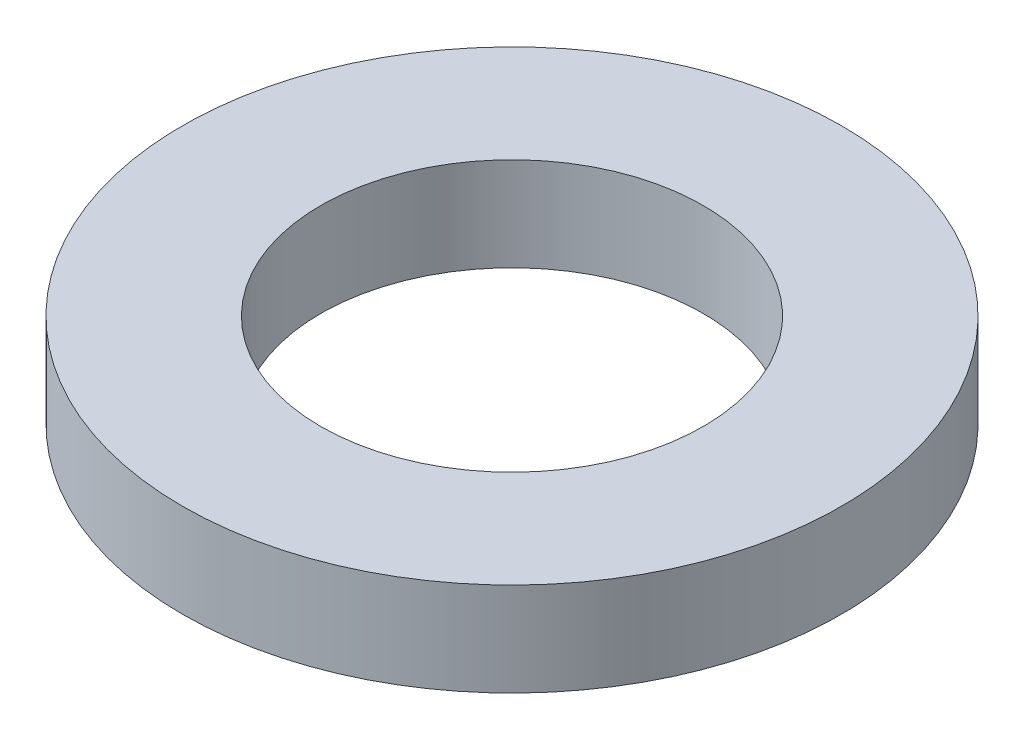
ISO-10303-21;
HEADER;
FILE_DESCRIPTION(('STEP AP214'),'2;1');
FILE_NAME('part.step','',(''),(''),'','','');
FILE_SCHEMA(('AUTOMOTIVE_DESIGN { 1 0 10303 214 1 1 1 1 }'));
ENDSEC;
DATA;
#1=APPLICATION_CONTEXT('core data for automotive mechanical design processes');
#2=APPLICATION_PROTOCOL_DEFINITION('international standard','automotive_design',2000,#1);
#3=PRODUCT_CONTEXT('',#1,'mechanical');
#4=PRODUCT('Part','Part','',(#3));
#5=PRODUCT_RELATED_PRODUCT_CATEGORY('part','',(#4));
#6=PRODUCT_DEFINITION_FORMATION('','',#4);
#7=PRODUCT_DEFINITION_CONTEXT('part definition',#1,'design');
#8=PRODUCT_DEFINITION('design','',#6,#7);
#9=PRODUCT_DEFINITION_SHAPE('','',#8);
#10=(LENGTH_UNIT() NAMED_UNIT(*) SI_UNIT(.MILLI.,.METRE.));
#11=(NAMED_UNIT(*) PLANE_ANGLE_UNIT() SI_UNIT($,.RADIAN.));
#12=(NAMED_UNIT(*) SI_UNIT($,.STERADIAN.) SOLID_ANGLE_UNIT());
#13=UNCERTAINTY_MEASURE_WITH_UNIT(LENGTH_MEASURE(1.E-05),#10,'distance_accuracy_value','');
#14=(GEOMETRIC_REPRESENTATION_CONTEXT(3) GLOBAL_UNCERTAINTY_ASSIGNED_CONTEXT((#13)) GLOBAL_UNIT_ASSIGNED_CONTEXT((#10,
#11,#12)) REPRESENTATION_CONTEXT('',''));
#15=CARTESIAN_POINT('',(0.,0.,0.));
#16=DIRECTION('',(0.,0.,1.));
#17=DIRECTION('',(1.,0.,0.));
#18=AXIS2_PLACEMENT_3D('',#15,#16,#17);
#19=CARTESIAN_POINT('',(0.,22.,0.));
#20=DIRECTION('',(0.,-1.,0.));
#21=DIRECTION('',(0.,0.,-1.));
#22=AXIS2_PLACEMENT_3D('',#19,#20,#21);
#23=CYLINDRICAL_SURFACE('',#22,77.5);
#24=CARTESIAN_POINT('',(0.,22.,0.));
#25=DIRECTION('',(0.,1.,0.));
#26=DIRECTION('',(0.,0.,1.));
#27=AXIS2_PLACEMENT_3D('',#24,#25,#26);
#28=CIRCLE('',#27,77.5);
#29=CARTESIAN_POINT('',(0.,22.,77.5));
#30=VERTEX_POINT('',#29);
#31=EDGE_CURVE('E10',#30,#30,#28,.T.);
#32=ORIENTED_EDGE('',*,*,#31,.F.);
#33=EDGE_LOOP('',(#32));
#34=FACE_BOUND('',#33,.T.);
#35=CARTESIAN_POINT('',(0.,0.,0.));
#36=DIRECTION('',(0.,1.,0.));
#37=DIRECTION('',(0.,0.,1.));
#38=AXIS2_PLACEMENT_3D('',#35,#36,#37);
#39=CIRCLE('',#38,77.5);
#40=CARTESIAN_POINT('',(0.,0.,77.5));
#41=VERTEX_POINT('',#40);
#42=EDGE_CURVE('E37',#41,#41,#39,.T.);
#43=ORIENTED_EDGE('',*,*,#42,.T.);
#44=EDGE_LOOP('',(#43));
#45=FACE_BOUND('',#44,.T.);
#46=ADVANCED_FACE('F40',(#34,#45),#23,.T.);
#47=CARTESIAN_POINT('',(0.,22.,0.));
#48=DIRECTION('',(0.,1.,0.));
#49=DIRECTION('',(0.,0.,1.));
#50=AXIS2_PLACEMENT_3D('',#47,#48,#49);
#51=PLANE('',#50);
#52=CARTESIAN_POINT('',(0.,22.,0.));
#53=DIRECTION('',(0.,1.,0.));
#54=DIRECTION('',(0.,0.,1.));
#55=AXIS2_PLACEMENT_3D('',#52,#53,#54);
#56=CIRCLE('',#55,45.);
#57=CARTESIAN_POINT('',(0.,22.,45.));
#58=VERTEX_POINT('',#57);
#59=EDGE_CURVE('E50',#58,#58,#56,.T.);
#60=ORIENTED_EDGE('',*,*,#59,.F.);
#61=EDGE_LOOP('',(#60));
#62=FACE_BOUND('',#61,.T.);
#63=ORIENTED_EDGE('',*,*,#31,.T.);
#64=EDGE_LOOP('',(#63));
#65=FACE_BOUND('',#64,.T.);
#66=ADVANCED_FACE('F59',(#62,#65),#51,.T.);
#67=CARTESIAN_POINT('',(0.,0.,0.));
#68=DIRECTION('',(0.,1.,0.));
#69=DIRECTION('',(0.,0.,1.));
#70=AXIS2_PLACEMENT_3D('',#67,#68,#69);
#71=PLANE('',#70);
#72=CARTESIAN_POINT('',(0.,0.,0.));
#73=DIRECTION('',(0.,1.,0.));
#74=DIRECTION('',(0.,0.,1.));
#75=AXIS2_PLACEMENT_3D('',#72,#73,#74);
#76=CIRCLE('',#75,45.);
#77=CARTESIAN_POINT('',(0.,0.,45.));
#78=VERTEX_POINT('',#77);
#79=EDGE_CURVE('E47',#78,#78,#76,.T.);
#80=ORIENTED_EDGE('',*,*,#79,.T.);
#81=EDGE_LOOP('',(#80));
#82=FACE_BOUND('',#81,.T.);
#83=ORIENTED_EDGE('',*,*,#42,.F.);
#84=EDGE_LOOP('',(#83));
#85=FACE_BOUND('',#84,.T.);
#86=ADVANCED_FACE('F58',(#82,#85),#71,.F.);
#87=CARTESIAN_POINT('',(0.,22.,0.));
#88=DIRECTION('',(0.,-1.,0.));
#89=DIRECTION('',(0.,0.,-1.));
#90=AXIS2_PLACEMENT_3D('',#87,#88,#89);
#91=CYLINDRICAL_SURFACE('',#90,45.);
#92=ORIENTED_EDGE('',*,*,#59,.T.);
#93=EDGE_LOOP('',(#92));
#94=FACE_BOUND('',#93,.T.);
#95=ORIENTED_EDGE('',*,*,#79,.F.);
#96=EDGE_LOOP('',(#95));
#97=FACE_BOUND('',#96,.T.);
#98=ADVANCED_FACE('F54',(#94,#97),#91,.F.);
#99=CLOSED_SHELL('',(#46,#66,#86,#98));
#100=MANIFOLD_SOLID_BREP('B2',#99);
#101=ADVANCED_BREP_SHAPE_REPRESENTATION('',(#18,#100),#14);
#102=SHAPE_DEFINITION_REPRESENTATION(#9,#101);
ENDSEC;
END-ISO-10303-21;
